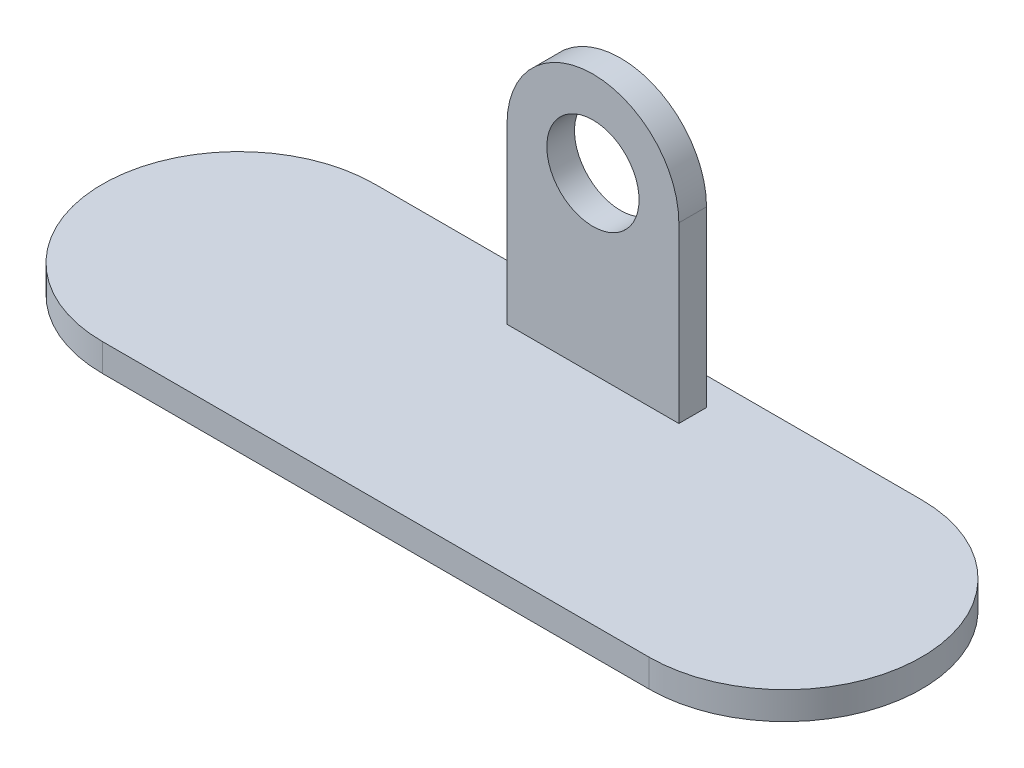
ISO-10303-21;
HEADER;
FILE_DESCRIPTION(('STEP AP214'),'2;1');
FILE_NAME('part.step','',(''),(''),'','','');
FILE_SCHEMA(('AUTOMOTIVE_DESIGN { 1 0 10303 214 1 1 1 1 }'));
ENDSEC;
DATA;
#1=APPLICATION_CONTEXT('core data for automotive mechanical design processes');
#2=APPLICATION_PROTOCOL_DEFINITION('international standard','automotive_design',2000,#1);
#3=PRODUCT_CONTEXT('',#1,'mechanical');
#4=PRODUCT('Part','Part','',(#3));
#5=PRODUCT_RELATED_PRODUCT_CATEGORY('part','',(#4));
#6=PRODUCT_DEFINITION_FORMATION('','',#4);
#7=PRODUCT_DEFINITION_CONTEXT('part definition',#1,'design');
#8=PRODUCT_DEFINITION('design','',#6,#7);
#9=PRODUCT_DEFINITION_SHAPE('','',#8);
#10=(LENGTH_UNIT() NAMED_UNIT(*) SI_UNIT(.MILLI.,.METRE.));
#11=(NAMED_UNIT(*) PLANE_ANGLE_UNIT() SI_UNIT($,.RADIAN.));
#12=(NAMED_UNIT(*) SI_UNIT($,.STERADIAN.) SOLID_ANGLE_UNIT());
#13=UNCERTAINTY_MEASURE_WITH_UNIT(LENGTH_MEASURE(1.E-05),#10,'distance_accuracy_value','');
#14=(GEOMETRIC_REPRESENTATION_CONTEXT(3) GLOBAL_UNCERTAINTY_ASSIGNED_CONTEXT((#13)) GLOBAL_UNIT_ASSIGNED_CONTEXT((#10,
#11,#12)) REPRESENTATION_CONTEXT('',''));
#15=CARTESIAN_POINT('',(0.,0.,0.));
#16=DIRECTION('',(0.,0.,1.));
#17=DIRECTION('',(1.,0.,0.));
#18=AXIS2_PLACEMENT_3D('',#15,#16,#17);
#19=CARTESIAN_POINT('',(-88.9,9.,0.));
#20=DIRECTION('',(0.,1.,0.));
#21=DIRECTION('',(0.,0.,1.));
#22=AXIS2_PLACEMENT_3D('',#19,#20,#21);
#23=PLANE('',#22);
#24=CARTESIAN_POINT('',(-88.9,9.,0.));
#25=DIRECTION('',(0.,1.,0.));
#26=DIRECTION('',(0.,0.,1.));
#27=AXIS2_PLACEMENT_3D('',#24,#25,#26);
#28=CIRCLE('',#27,44.323);
#29=CARTESIAN_POINT('',(-88.9,9.,-44.323));
#30=VERTEX_POINT('',#29);
#31=CARTESIAN_POINT('',(-88.9,9.,44.323));
#32=VERTEX_POINT('',#31);
#33=EDGE_CURVE('E195',#30,#32,#28,.T.);
#34=ORIENTED_EDGE('',*,*,#33,.T.);
#35=DIRECTION('',(1.,0.,0.));
#36=VECTOR('',#35,1.);
#37=CARTESIAN_POINT('',(-88.9,9.,44.323));
#38=LINE('',#37,#36);
#39=CARTESIAN_POINT('',(88.9,9.,44.323));
#40=VERTEX_POINT('',#39);
#41=EDGE_CURVE('E103',#32,#40,#38,.T.);
#42=ORIENTED_EDGE('',*,*,#41,.T.);
#43=CARTESIAN_POINT('',(88.9,9.,0.));
#44=DIRECTION('',(0.,1.,0.));
#45=DIRECTION('',(0.,0.,1.));
#46=AXIS2_PLACEMENT_3D('',#43,#44,#45);
#47=CIRCLE('',#46,44.323);
#48=CARTESIAN_POINT('',(88.9,9.,-44.323));
#49=VERTEX_POINT('',#48);
#50=EDGE_CURVE('E201',#40,#49,#47,.T.);
#51=ORIENTED_EDGE('',*,*,#50,.T.);
#52=DIRECTION('',(-1.,0.,0.));
#53=VECTOR('',#52,1.);
#54=CARTESIAN_POINT('',(-88.9,9.,-44.323));
#55=LINE('',#54,#53);
#56=EDGE_CURVE('E75',#49,#30,#55,.T.);
#57=ORIENTED_EDGE('',*,*,#56,.T.);
#58=EDGE_LOOP('',(#34,#42,#51,#57));
#59=FACE_BOUND('',#58,.T.);
#60=DIRECTION('',(-1.,0.,0.));
#61=VECTOR('',#60,1.);
#62=CARTESIAN_POINT('',(-27.94,9.,-35.323));
#63=LINE('',#62,#61);
#64=CARTESIAN_POINT('',(27.94,9.,-35.323));
#65=VERTEX_POINT('',#64);
#66=CARTESIAN_POINT('',(-27.94,9.,-35.323));
#67=VERTEX_POINT('',#66);
#68=EDGE_CURVE('E185',#65,#67,#63,.T.);
#69=ORIENTED_EDGE('',*,*,#68,.F.);
#70=DIRECTION('',(0.,0.,-1.));
#71=VECTOR('',#70,1.);
#72=CARTESIAN_POINT('',(27.94,9.,-26.323));
#73=LINE('',#72,#71);
#74=CARTESIAN_POINT('',(27.94,9.,-26.323));
#75=VERTEX_POINT('',#74);
#76=EDGE_CURVE('E145',#75,#65,#73,.T.);
#77=ORIENTED_EDGE('',*,*,#76,.F.);
#78=DIRECTION('',(1.,0.,0.));
#79=VECTOR('',#78,1.);
#80=CARTESIAN_POINT('',(-27.94,9.,-26.323));
#81=LINE('',#80,#79);
#82=CARTESIAN_POINT('',(-27.94,9.,-26.323));
#83=VERTEX_POINT('',#82);
#84=EDGE_CURVE('E66',#83,#75,#81,.T.);
#85=ORIENTED_EDGE('',*,*,#84,.F.);
#86=DIRECTION('',(0.,0.,1.));
#87=VECTOR('',#86,1.);
#88=CARTESIAN_POINT('',(-27.94,9.,-35.323));
#89=LINE('',#88,#87);
#90=EDGE_CURVE('E189',#67,#83,#89,.T.);
#91=ORIENTED_EDGE('',*,*,#90,.F.);
#92=EDGE_LOOP('',(#69,#77,#85,#91));
#93=FACE_BOUND('',#92,.T.);
#94=ADVANCED_FACE('F50',(#59,#93),#23,.T.);
#95=CARTESIAN_POINT('',(-88.9,0.,0.));
#96=DIRECTION('',(0.,1.,0.));
#97=DIRECTION('',(0.,0.,1.));
#98=AXIS2_PLACEMENT_3D('',#95,#96,#97);
#99=PLANE('',#98);
#100=CARTESIAN_POINT('',(-88.9,0.,0.));
#101=DIRECTION('',(0.,1.,0.));
#102=DIRECTION('',(0.,0.,1.));
#103=AXIS2_PLACEMENT_3D('',#100,#101,#102);
#104=CIRCLE('',#103,44.323);
#105=CARTESIAN_POINT('',(-88.9,0.,-44.323));
#106=VERTEX_POINT('',#105);
#107=CARTESIAN_POINT('',(-88.9,0.,44.323));
#108=VERTEX_POINT('',#107);
#109=EDGE_CURVE('E194',#106,#108,#104,.T.);
#110=ORIENTED_EDGE('',*,*,#109,.F.);
#111=DIRECTION('',(-1.,0.,0.));
#112=VECTOR('',#111,1.);
#113=CARTESIAN_POINT('',(-88.9,0.,-44.323));
#114=LINE('',#113,#112);
#115=CARTESIAN_POINT('',(88.9,0.,-44.323));
#116=VERTEX_POINT('',#115);
#117=EDGE_CURVE('E96',#116,#106,#114,.T.);
#118=ORIENTED_EDGE('',*,*,#117,.F.);
#119=CARTESIAN_POINT('',(88.9,0.,0.));
#120=DIRECTION('',(0.,1.,0.));
#121=DIRECTION('',(0.,0.,1.));
#122=AXIS2_PLACEMENT_3D('',#119,#120,#121);
#123=CIRCLE('',#122,44.323);
#124=CARTESIAN_POINT('',(88.9,0.,44.323));
#125=VERTEX_POINT('',#124);
#126=EDGE_CURVE('E209',#125,#116,#123,.T.);
#127=ORIENTED_EDGE('',*,*,#126,.F.);
#128=DIRECTION('',(1.,0.,0.));
#129=VECTOR('',#128,1.);
#130=CARTESIAN_POINT('',(-88.9,0.,44.323));
#131=LINE('',#130,#129);
#132=EDGE_CURVE('E205',#108,#125,#131,.T.);
#133=ORIENTED_EDGE('',*,*,#132,.F.);
#134=EDGE_LOOP('',(#110,#118,#127,#133));
#135=FACE_BOUND('',#134,.T.);
#136=ADVANCED_FACE('F229',(#135),#99,.F.);
#137=CARTESIAN_POINT('',(-88.9,9.,0.));
#138=DIRECTION('',(0.,-1.,0.));
#139=DIRECTION('',(0.,0.,-1.));
#140=AXIS2_PLACEMENT_3D('',#137,#138,#139);
#141=CYLINDRICAL_SURFACE('',#140,44.323);
#142=ORIENTED_EDGE('',*,*,#109,.T.);
#143=DIRECTION('',(0.,-1.,0.));
#144=VECTOR('',#143,1.);
#145=CARTESIAN_POINT('',(-88.9,9.,44.323));
#146=LINE('',#145,#144);
#147=EDGE_CURVE('E12',#32,#108,#146,.T.);
#148=ORIENTED_EDGE('',*,*,#147,.F.);
#149=ORIENTED_EDGE('',*,*,#33,.F.);
#150=DIRECTION('',(0.,-1.,0.));
#151=VECTOR('',#150,1.);
#152=CARTESIAN_POINT('',(-88.9,9.,-44.323));
#153=LINE('',#152,#151);
#154=EDGE_CURVE('E215',#30,#106,#153,.T.);
#155=ORIENTED_EDGE('',*,*,#154,.T.);
#156=EDGE_LOOP('',(#142,#148,#149,#155));
#157=FACE_BOUND('',#156,.T.);
#158=ADVANCED_FACE('F52',(#157),#141,.T.);
#159=CARTESIAN_POINT('',(-88.9,9.,44.323));
#160=DIRECTION('',(0.,0.,-1.));
#161=DIRECTION('',(-1.,0.,0.));
#162=AXIS2_PLACEMENT_3D('',#159,#160,#161);
#163=PLANE('',#162);
#164=ORIENTED_EDGE('',*,*,#132,.T.);
#165=DIRECTION('',(0.,-1.,0.));
#166=VECTOR('',#165,1.);
#167=CARTESIAN_POINT('',(88.9,9.,44.323));
#168=LINE('',#167,#166);
#169=EDGE_CURVE('E59',#40,#125,#168,.T.);
#170=ORIENTED_EDGE('',*,*,#169,.F.);
#171=ORIENTED_EDGE('',*,*,#41,.F.);
#172=ORIENTED_EDGE('',*,*,#147,.T.);
#173=EDGE_LOOP('',(#164,#170,#171,#172));
#174=FACE_BOUND('',#173,.T.);
#175=ADVANCED_FACE('F238',(#174),#163,.F.);
#176=CARTESIAN_POINT('',(88.9,9.,0.));
#177=DIRECTION('',(0.,-1.,0.));
#178=DIRECTION('',(0.,0.,-1.));
#179=AXIS2_PLACEMENT_3D('',#176,#177,#178);
#180=CYLINDRICAL_SURFACE('',#179,44.323);
#181=ORIENTED_EDGE('',*,*,#126,.T.);
#182=DIRECTION('',(0.,-1.,0.));
#183=VECTOR('',#182,1.);
#184=CARTESIAN_POINT('',(88.9,9.,-44.323));
#185=LINE('',#184,#183);
#186=EDGE_CURVE('E218',#49,#116,#185,.T.);
#187=ORIENTED_EDGE('',*,*,#186,.F.);
#188=ORIENTED_EDGE('',*,*,#50,.F.);
#189=ORIENTED_EDGE('',*,*,#169,.T.);
#190=EDGE_LOOP('',(#181,#187,#188,#189));
#191=FACE_BOUND('',#190,.T.);
#192=ADVANCED_FACE('F225',(#191),#180,.T.);
#193=CARTESIAN_POINT('',(-88.9,9.,-44.323));
#194=DIRECTION('',(0.,0.,1.));
#195=DIRECTION('',(1.,0.,0.));
#196=AXIS2_PLACEMENT_3D('',#193,#194,#195);
#197=PLANE('',#196);
#198=ORIENTED_EDGE('',*,*,#117,.T.);
#199=ORIENTED_EDGE('',*,*,#154,.F.);
#200=ORIENTED_EDGE('',*,*,#56,.F.);
#201=ORIENTED_EDGE('',*,*,#186,.T.);
#202=EDGE_LOOP('',(#198,#199,#200,#201));
#203=FACE_BOUND('',#202,.T.);
#204=ADVANCED_FACE('F236',(#203),#197,.F.);
#205=CARTESIAN_POINT('',(0.,65.532,-26.323));
#206=DIRECTION('',(0.,0.,1.));
#207=DIRECTION('',(1.,0.,0.));
#208=AXIS2_PLACEMENT_3D('',#205,#206,#207);
#209=PLANE('',#208);
#210=DIRECTION('',(0.,-1.,0.));
#211=VECTOR('',#210,1.);
#212=CARTESIAN_POINT('',(-27.94,65.532,-26.323));
#213=LINE('',#212,#211);
#214=CARTESIAN_POINT('',(-27.94,65.532,-26.323));
#215=VERTEX_POINT('',#214);
#216=EDGE_CURVE('E135',#215,#83,#213,.T.);
#217=ORIENTED_EDGE('',*,*,#216,.T.);
#218=ORIENTED_EDGE('',*,*,#84,.T.);
#219=DIRECTION('',(0.,1.,0.));
#220=VECTOR('',#219,1.);
#221=CARTESIAN_POINT('',(27.94,0.,-26.323));
#222=LINE('',#221,#220);
#223=CARTESIAN_POINT('',(27.94,65.532,-26.323));
#224=VERTEX_POINT('',#223);
#225=EDGE_CURVE('E124',#75,#224,#222,.T.);
#226=ORIENTED_EDGE('',*,*,#225,.T.);
#227=CARTESIAN_POINT('',(0.,65.532,-26.323));
#228=DIRECTION('',(0.,0.,1.));
#229=DIRECTION('',(1.,0.,0.));
#230=AXIS2_PLACEMENT_3D('',#227,#228,#229);
#231=CIRCLE('',#230,27.94);
#232=EDGE_CURVE('E130',#224,#215,#231,.T.);
#233=ORIENTED_EDGE('',*,*,#232,.T.);
#234=EDGE_LOOP('',(#217,#218,#226,#233));
#235=FACE_BOUND('',#234,.T.);
#236=CARTESIAN_POINT('',(0.,65.532,-26.323));
#237=DIRECTION('',(0.,0.,1.));
#238=DIRECTION('',(1.,0.,0.));
#239=AXIS2_PLACEMENT_3D('',#236,#237,#238);
#240=CIRCLE('',#239,15.);
#241=CARTESIAN_POINT('',(15.,65.532,-26.323));
#242=VERTEX_POINT('',#241);
#243=EDGE_CURVE('E163',#242,#242,#240,.T.);
#244=ORIENTED_EDGE('',*,*,#243,.F.);
#245=EDGE_LOOP('',(#244));
#246=FACE_BOUND('',#245,.T.);
#247=ADVANCED_FACE('F127',(#235,#246),#209,.T.);
#248=CARTESIAN_POINT('',(0.,65.532,-35.323));
#249=DIRECTION('',(0.,0.,1.));
#250=DIRECTION('',(1.,0.,0.));
#251=AXIS2_PLACEMENT_3D('',#248,#249,#250);
#252=PLANE('',#251);
#253=ORIENTED_EDGE('',*,*,#68,.T.);
#254=DIRECTION('',(0.,-1.,0.));
#255=VECTOR('',#254,1.);
#256=CARTESIAN_POINT('',(-27.94,65.532,-35.323));
#257=LINE('',#256,#255);
#258=CARTESIAN_POINT('',(-27.94,65.532,-35.323));
#259=VERTEX_POINT('',#258);
#260=EDGE_CURVE('E158',#259,#67,#257,.T.);
#261=ORIENTED_EDGE('',*,*,#260,.F.);
#262=CARTESIAN_POINT('',(0.,65.532,-35.323));
#263=DIRECTION('',(0.,0.,1.));
#264=DIRECTION('',(1.,0.,0.));
#265=AXIS2_PLACEMENT_3D('',#262,#263,#264);
#266=CIRCLE('',#265,27.94);
#267=CARTESIAN_POINT('',(27.94,65.532,-35.323));
#268=VERTEX_POINT('',#267);
#269=EDGE_CURVE('E179',#268,#259,#266,.T.);
#270=ORIENTED_EDGE('',*,*,#269,.F.);
#271=DIRECTION('',(0.,1.,0.));
#272=VECTOR('',#271,1.);
#273=CARTESIAN_POINT('',(27.94,0.,-35.323));
#274=LINE('',#273,#272);
#275=EDGE_CURVE('E141',#65,#268,#274,.T.);
#276=ORIENTED_EDGE('',*,*,#275,.F.);
#277=EDGE_LOOP('',(#253,#261,#270,#276));
#278=FACE_BOUND('',#277,.T.);
#279=CARTESIAN_POINT('',(0.,65.532,-35.323));
#280=DIRECTION('',(0.,0.,1.));
#281=DIRECTION('',(1.,0.,0.));
#282=AXIS2_PLACEMENT_3D('',#279,#280,#281);
#283=CIRCLE('',#282,15.);
#284=CARTESIAN_POINT('',(15.,65.532,-35.323));
#285=VERTEX_POINT('',#284);
#286=EDGE_CURVE('E174',#285,#285,#283,.T.);
#287=ORIENTED_EDGE('',*,*,#286,.T.);
#288=EDGE_LOOP('',(#287));
#289=FACE_BOUND('',#288,.T.);
#290=ADVANCED_FACE('F259',(#278,#289),#252,.F.);
#291=CARTESIAN_POINT('',(-27.94,65.532,-26.323));
#292=DIRECTION('',(1.,0.,0.));
#293=DIRECTION('',(0.,1.,0.));
#294=AXIS2_PLACEMENT_3D('',#291,#292,#293);
#295=PLANE('',#294);
#296=ORIENTED_EDGE('',*,*,#90,.T.);
#297=ORIENTED_EDGE('',*,*,#216,.F.);
#298=DIRECTION('',(0.,0.,-1.));
#299=VECTOR('',#298,1.);
#300=CARTESIAN_POINT('',(-27.94,65.532,-26.323));
#301=LINE('',#300,#299);
#302=EDGE_CURVE('E146',#215,#259,#301,.T.);
#303=ORIENTED_EDGE('',*,*,#302,.T.);
#304=ORIENTED_EDGE('',*,*,#260,.T.);
#305=EDGE_LOOP('',(#296,#297,#303,#304));
#306=FACE_BOUND('',#305,.T.);
#307=ADVANCED_FACE('F253',(#306),#295,.F.);
#308=CARTESIAN_POINT('',(27.94,0.,-26.323));
#309=DIRECTION('',(-1.,0.,0.));
#310=DIRECTION('',(0.,-1.,0.));
#311=AXIS2_PLACEMENT_3D('',#308,#309,#310);
#312=PLANE('',#311);
#313=ORIENTED_EDGE('',*,*,#76,.T.);
#314=ORIENTED_EDGE('',*,*,#275,.T.);
#315=DIRECTION('',(0.,0.,-1.));
#316=VECTOR('',#315,1.);
#317=CARTESIAN_POINT('',(27.94,65.532,-26.323));
#318=LINE('',#317,#316);
#319=EDGE_CURVE('E138',#224,#268,#318,.T.);
#320=ORIENTED_EDGE('',*,*,#319,.F.);
#321=ORIENTED_EDGE('',*,*,#225,.F.);
#322=EDGE_LOOP('',(#313,#314,#320,#321));
#323=FACE_BOUND('',#322,.T.);
#324=ADVANCED_FACE('F139',(#323),#312,.F.);
#325=CARTESIAN_POINT('',(0.,65.532,-26.323));
#326=DIRECTION('',(0.,0.,-1.));
#327=DIRECTION('',(-1.,0.,0.));
#328=AXIS2_PLACEMENT_3D('',#325,#326,#327);
#329=CYLINDRICAL_SURFACE('',#328,27.94);
#330=ORIENTED_EDGE('',*,*,#269,.T.);
#331=ORIENTED_EDGE('',*,*,#302,.F.);
#332=ORIENTED_EDGE('',*,*,#232,.F.);
#333=ORIENTED_EDGE('',*,*,#319,.T.);
#334=EDGE_LOOP('',(#330,#331,#332,#333));
#335=FACE_BOUND('',#334,.T.);
#336=ADVANCED_FACE('F148',(#335),#329,.T.);
#337=CARTESIAN_POINT('',(0.,65.532,-26.323));
#338=DIRECTION('',(0.,0.,-1.));
#339=DIRECTION('',(-1.,0.,0.));
#340=AXIS2_PLACEMENT_3D('',#337,#338,#339);
#341=CYLINDRICAL_SURFACE('',#340,15.);
#342=ORIENTED_EDGE('',*,*,#243,.T.);
#343=EDGE_LOOP('',(#342));
#344=FACE_BOUND('',#343,.T.);
#345=ORIENTED_EDGE('',*,*,#286,.F.);
#346=EDGE_LOOP('',(#345));
#347=FACE_BOUND('',#346,.T.);
#348=ADVANCED_FACE('F267',(#344,#347),#341,.F.);
#349=CLOSED_SHELL('',(#94,#136,#158,#175,#192,#204,#247,#290,#307,#324,#336,#348));
#350=MANIFOLD_SOLID_BREP('B2',#349);
#351=ADVANCED_BREP_SHAPE_REPRESENTATION('',(#18,#350),#14);
#352=SHAPE_DEFINITION_REPRESENTATION(#9,#351);
ENDSEC;
END-ISO-10303-21;
